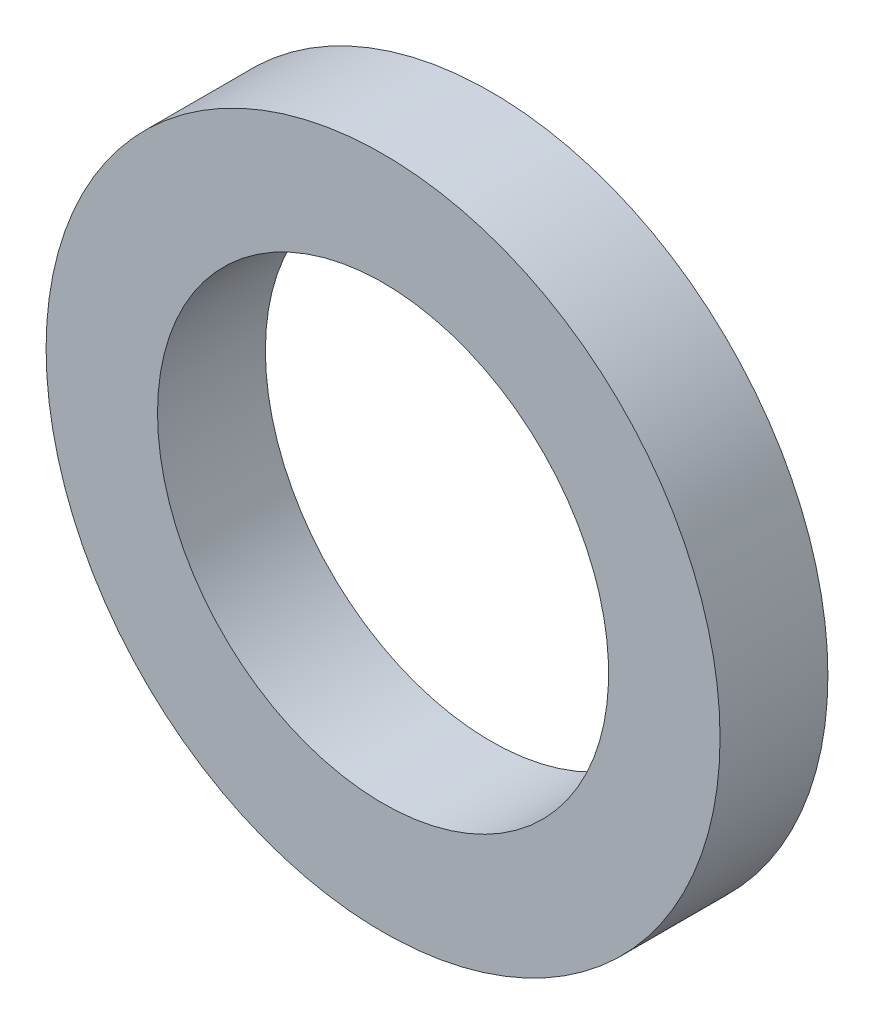
ISO-10303-21;
HEADER;
FILE_DESCRIPTION(('STEP AP214'),'2;1');
FILE_NAME('part.step','',(''),(''),'','','');
FILE_SCHEMA(('AUTOMOTIVE_DESIGN { 1 0 10303 214 1 1 1 1 }'));
ENDSEC;
DATA;
#1=APPLICATION_CONTEXT('core data for automotive mechanical design processes');
#2=APPLICATION_PROTOCOL_DEFINITION('international standard','automotive_design',2000,#1);
#3=PRODUCT_CONTEXT('',#1,'mechanical');
#4=PRODUCT('Part','Part','',(#3));
#5=PRODUCT_RELATED_PRODUCT_CATEGORY('part','',(#4));
#6=PRODUCT_DEFINITION_FORMATION('','',#4);
#7=PRODUCT_DEFINITION_CONTEXT('part definition',#1,'design');
#8=PRODUCT_DEFINITION('design','',#6,#7);
#9=PRODUCT_DEFINITION_SHAPE('','',#8);
#10=(LENGTH_UNIT() NAMED_UNIT(*) SI_UNIT(.MILLI.,.METRE.));
#11=(NAMED_UNIT(*) PLANE_ANGLE_UNIT() SI_UNIT($,.RADIAN.));
#12=(NAMED_UNIT(*) SI_UNIT($,.STERADIAN.) SOLID_ANGLE_UNIT());
#13=UNCERTAINTY_MEASURE_WITH_UNIT(LENGTH_MEASURE(1.E-05),#10,'distance_accuracy_value','');
#14=(GEOMETRIC_REPRESENTATION_CONTEXT(3) GLOBAL_UNCERTAINTY_ASSIGNED_CONTEXT((#13)) GLOBAL_UNIT_ASSIGNED_CONTEXT((#10,
#11,#12)) REPRESENTATION_CONTEXT('',''));
#15=CARTESIAN_POINT('',(0.,0.,0.));
#16=DIRECTION('',(0.,0.,1.));
#17=DIRECTION('',(1.,0.,0.));
#18=AXIS2_PLACEMENT_3D('',#15,#16,#17);
#19=CARTESIAN_POINT('',(0.,0.,-1.524));
#20=DIRECTION('',(0.,0.,-1.));
#21=DIRECTION('',(1.,0.,0.));
#22=AXIS2_PLACEMENT_3D('',#19,#20,#21);
#23=PLANE('',#22);
#24=CARTESIAN_POINT('',(0.,0.,-1.524));
#25=DIRECTION('',(0.,0.,1.));
#26=DIRECTION('',(1.,0.,0.));
#27=AXIS2_PLACEMENT_3D('',#24,#25,#26);
#28=CIRCLE('',#27,4.7625);
#29=CARTESIAN_POINT('',(-4.7625,0.,-1.524));
#30=VERTEX_POINT('',#29);
#31=EDGE_CURVE('E10',#30,#30,#28,.T.);
#32=ORIENTED_EDGE('',*,*,#31,.F.);
#33=EDGE_LOOP('',(#32));
#34=FACE_BOUND('',#33,.T.);
#35=CARTESIAN_POINT('',(0.,0.,-1.524));
#36=DIRECTION('',(0.,0.,1.));
#37=DIRECTION('',(1.,0.,0.));
#38=AXIS2_PLACEMENT_3D('',#35,#36,#37);
#39=CIRCLE('',#38,3.1877);
#40=CARTESIAN_POINT('',(-3.1877,0.,-1.524));
#41=VERTEX_POINT('',#40);
#42=EDGE_CURVE('E41',#41,#41,#39,.T.);
#43=ORIENTED_EDGE('',*,*,#42,.T.);
#44=EDGE_LOOP('',(#43));
#45=FACE_BOUND('',#44,.T.);
#46=ADVANCED_FACE('F30',(#34,#45),#23,.T.);
#47=CARTESIAN_POINT('',(0.,0.,0.));
#48=DIRECTION('',(0.,0.,-1.));
#49=DIRECTION('',(1.,0.,0.));
#50=AXIS2_PLACEMENT_3D('',#47,#48,#49);
#51=PLANE('',#50);
#52=CARTESIAN_POINT('',(0.,0.,0.));
#53=DIRECTION('',(0.,0.,1.));
#54=DIRECTION('',(1.,0.,0.));
#55=AXIS2_PLACEMENT_3D('',#52,#53,#54);
#56=CIRCLE('',#55,4.7625);
#57=CARTESIAN_POINT('',(-4.7625,0.,0.));
#58=VERTEX_POINT('',#57);
#59=EDGE_CURVE('E34',#58,#58,#56,.T.);
#60=ORIENTED_EDGE('',*,*,#59,.T.);
#61=EDGE_LOOP('',(#60));
#62=FACE_BOUND('',#61,.T.);
#63=CARTESIAN_POINT('',(0.,0.,0.));
#64=DIRECTION('',(0.,0.,1.));
#65=DIRECTION('',(1.,0.,0.));
#66=AXIS2_PLACEMENT_3D('',#63,#64,#65);
#67=CIRCLE('',#66,3.1877);
#68=CARTESIAN_POINT('',(-3.1877,0.,0.));
#69=VERTEX_POINT('',#68);
#70=EDGE_CURVE('E43',#69,#69,#67,.T.);
#71=ORIENTED_EDGE('',*,*,#70,.F.);
#72=EDGE_LOOP('',(#71));
#73=FACE_BOUND('',#72,.T.);
#74=ADVANCED_FACE('F56',(#62,#73),#51,.F.);
#75=CARTESIAN_POINT('',(0.,0.,-1.524));
#76=DIRECTION('',(0.,0.,1.));
#77=DIRECTION('',(-1.,0.,0.));
#78=AXIS2_PLACEMENT_3D('',#75,#76,#77);
#79=CYLINDRICAL_SURFACE('',#78,4.7625);
#80=CARTESIAN_POINT('',(-4.7625,0.,-1.524));
#81=CARTESIAN_POINT('',(-4.7625,0.,-1.508125));
#82=CARTESIAN_POINT('',(-4.7625,0.,-1.49225));
#83=CARTESIAN_POINT('',(-4.7625,0.,-1.4605));
#84=CARTESIAN_POINT('',(-4.7625,0.,-1.444625));
#85=CARTESIAN_POINT('',(-4.7625,0.,-1.412875));
#86=CARTESIAN_POINT('',(-4.7625,0.,-1.397));
#87=CARTESIAN_POINT('',(-4.7625,0.,-1.36525));
#88=CARTESIAN_POINT('',(-4.7625,0.,-1.349375));
#89=CARTESIAN_POINT('',(-4.7625,0.,-1.317625));
#90=CARTESIAN_POINT('',(-4.7625,0.,-1.30175));
#91=CARTESIAN_POINT('',(-4.7625,0.,-1.27));
#92=CARTESIAN_POINT('',(-4.7625,0.,-1.254125));
#93=CARTESIAN_POINT('',(-4.7625,0.,-1.222375));
#94=CARTESIAN_POINT('',(-4.7625,0.,-1.2065));
#95=CARTESIAN_POINT('',(-4.7625,0.,-1.17475));
#96=CARTESIAN_POINT('',(-4.7625,0.,-1.158875));
#97=CARTESIAN_POINT('',(-4.7625,0.,-1.127125));
#98=CARTESIAN_POINT('',(-4.7625,0.,-1.11125));
#99=CARTESIAN_POINT('',(-4.7625,0.,-1.0795));
#100=CARTESIAN_POINT('',(-4.7625,0.,-1.063625));
#101=CARTESIAN_POINT('',(-4.7625,0.,-1.031875));
#102=CARTESIAN_POINT('',(-4.7625,0.,-1.016));
#103=CARTESIAN_POINT('',(-4.7625,0.,-0.98425));
#104=CARTESIAN_POINT('',(-4.7625,0.,-0.968375));
#105=CARTESIAN_POINT('',(-4.7625,0.,-0.936625));
#106=CARTESIAN_POINT('',(-4.7625,0.,-0.92075));
#107=CARTESIAN_POINT('',(-4.7625,0.,-0.889));
#108=CARTESIAN_POINT('',(-4.7625,0.,-0.873125));
#109=CARTESIAN_POINT('',(-4.7625,0.,-0.841375));
#110=CARTESIAN_POINT('',(-4.7625,0.,-0.8255));
#111=CARTESIAN_POINT('',(-4.7625,0.,-0.79375));
#112=CARTESIAN_POINT('',(-4.7625,0.,-0.777875));
#113=CARTESIAN_POINT('',(-4.7625,0.,-0.746125));
#114=CARTESIAN_POINT('',(-4.7625,0.,-0.73025));
#115=CARTESIAN_POINT('',(-4.7625,0.,-0.6985));
#116=CARTESIAN_POINT('',(-4.7625,0.,-0.682625));
#117=CARTESIAN_POINT('',(-4.7625,0.,-0.650875));
#118=CARTESIAN_POINT('',(-4.7625,0.,-0.635));
#119=CARTESIAN_POINT('',(-4.7625,0.,-0.60325));
#120=CARTESIAN_POINT('',(-4.7625,0.,-0.587375));
#121=CARTESIAN_POINT('',(-4.7625,0.,-0.555625));
#122=CARTESIAN_POINT('',(-4.7625,0.,-0.53975));
#123=CARTESIAN_POINT('',(-4.7625,0.,-0.508));
#124=CARTESIAN_POINT('',(-4.7625,0.,-0.492125));
#125=CARTESIAN_POINT('',(-4.7625,0.,-0.460375));
#126=CARTESIAN_POINT('',(-4.7625,0.,-0.4445));
#127=CARTESIAN_POINT('',(-4.7625,0.,-0.41275));
#128=CARTESIAN_POINT('',(-4.7625,0.,-0.396875));
#129=CARTESIAN_POINT('',(-4.7625,0.,-0.365125));
#130=CARTESIAN_POINT('',(-4.7625,0.,-0.34925));
#131=CARTESIAN_POINT('',(-4.7625,0.,-0.3175));
#132=CARTESIAN_POINT('',(-4.7625,0.,-0.301625));
#133=CARTESIAN_POINT('',(-4.7625,0.,-0.269875));
#134=CARTESIAN_POINT('',(-4.7625,0.,-0.254));
#135=CARTESIAN_POINT('',(-4.7625,0.,-0.22225));
#136=CARTESIAN_POINT('',(-4.7625,0.,-0.206375));
#137=CARTESIAN_POINT('',(-4.7625,0.,-0.174625));
#138=CARTESIAN_POINT('',(-4.7625,0.,-0.15875));
#139=CARTESIAN_POINT('',(-4.7625,0.,-0.127));
#140=CARTESIAN_POINT('',(-4.7625,0.,-0.111125));
#141=CARTESIAN_POINT('',(-4.7625,0.,-0.079375));
#142=CARTESIAN_POINT('',(-4.7625,0.,-0.0635));
#143=CARTESIAN_POINT('',(-4.7625,0.,-0.0317499999999999));
#144=CARTESIAN_POINT('',(-4.7625,0.,-0.015875));
#145=CARTESIAN_POINT('',(-4.7625,0.,0.));
#146=B_SPLINE_CURVE_WITH_KNOTS('',3,(#80,#81,#82,#83,#84,#85,#86,#87,#88,#89,#90,#91,#92,#93,
#94,#95,#96,#97,#98,#99,#100,#101,#102,#103,#104,#105,#106,#107,#108,#109,#110,#111,#112,#113,
#114,#115,#116,#117,#118,#119,#120,#121,#122,#123,#124,#125,#126,#127,#128,#129,#130,#131,#132,
#133,#134,#135,#136,#137,#138,#139,#140,#141,#142,#143,#144,#145),.UNSPECIFIED.,.F.,.F.,(4,2,2,
2,2,2,2,2,2,2,2,2,2,2,2,2,2,2,2,2,2,2,2,2,2,2,2,2,2,2,2,2,4),(0.,0.0476250000000001,
0.0952500000000001,0.142875,0.1905,0.238125,0.28575,0.333375,0.381,0.428625,0.47625,0.523875,
0.5715,0.619125,0.66675,0.714375,0.762,0.809625,0.85725,0.904875,0.9525,1.000125,1.04775,
1.095375,1.143,1.190625,1.23825,1.285875,1.3335,1.381125,1.42875,1.476375,1.524),.UNSPECIFIED.);
#147=EDGE_CURVE('BSEAM32',#30,#58,#146,.T.);
#148=ORIENTED_EDGE('',*,*,#31,.T.);
#149=ORIENTED_EDGE('',*,*,#59,.F.);
#150=ORIENTED_EDGE('',*,*,#147,.T.);
#151=ORIENTED_EDGE('',*,*,#147,.F.);
#152=EDGE_LOOP('',(#148,#150,#149,#151));
#153=FACE_BOUND('',#152,.T.);
#154=ADVANCED_FACE('F32',(#153),#79,.T.);
#155=CARTESIAN_POINT('',(0.,0.,-1.524));
#156=DIRECTION('',(0.,0.,1.));
#157=DIRECTION('',(-1.,0.,0.));
#158=AXIS2_PLACEMENT_3D('',#155,#156,#157);
#159=CYLINDRICAL_SURFACE('',#158,3.1877);
#160=CARTESIAN_POINT('',(-3.1877,0.,-1.524));
#161=CARTESIAN_POINT('',(-3.1877,0.,-1.508125));
#162=CARTESIAN_POINT('',(-3.1877,0.,-1.49225));
#163=CARTESIAN_POINT('',(-3.1877,0.,-1.4605));
#164=CARTESIAN_POINT('',(-3.1877,0.,-1.444625));
#165=CARTESIAN_POINT('',(-3.1877,0.,-1.412875));
#166=CARTESIAN_POINT('',(-3.1877,0.,-1.397));
#167=CARTESIAN_POINT('',(-3.1877,0.,-1.36525));
#168=CARTESIAN_POINT('',(-3.1877,0.,-1.349375));
#169=CARTESIAN_POINT('',(-3.1877,0.,-1.317625));
#170=CARTESIAN_POINT('',(-3.1877,0.,-1.30175));
#171=CARTESIAN_POINT('',(-3.1877,0.,-1.27));
#172=CARTESIAN_POINT('',(-3.1877,0.,-1.254125));
#173=CARTESIAN_POINT('',(-3.1877,0.,-1.222375));
#174=CARTESIAN_POINT('',(-3.1877,0.,-1.2065));
#175=CARTESIAN_POINT('',(-3.1877,0.,-1.17475));
#176=CARTESIAN_POINT('',(-3.1877,0.,-1.158875));
#177=CARTESIAN_POINT('',(-3.1877,0.,-1.127125));
#178=CARTESIAN_POINT('',(-3.1877,0.,-1.11125));
#179=CARTESIAN_POINT('',(-3.1877,0.,-1.0795));
#180=CARTESIAN_POINT('',(-3.1877,0.,-1.063625));
#181=CARTESIAN_POINT('',(-3.1877,0.,-1.031875));
#182=CARTESIAN_POINT('',(-3.1877,0.,-1.016));
#183=CARTESIAN_POINT('',(-3.1877,0.,-0.98425));
#184=CARTESIAN_POINT('',(-3.1877,0.,-0.968375));
#185=CARTESIAN_POINT('',(-3.1877,0.,-0.936625));
#186=CARTESIAN_POINT('',(-3.1877,0.,-0.92075));
#187=CARTESIAN_POINT('',(-3.1877,0.,-0.889));
#188=CARTESIAN_POINT('',(-3.1877,0.,-0.873125));
#189=CARTESIAN_POINT('',(-3.1877,0.,-0.841375));
#190=CARTESIAN_POINT('',(-3.1877,0.,-0.8255));
#191=CARTESIAN_POINT('',(-3.1877,0.,-0.79375));
#192=CARTESIAN_POINT('',(-3.1877,0.,-0.777875));
#193=CARTESIAN_POINT('',(-3.1877,0.,-0.746125));
#194=CARTESIAN_POINT('',(-3.1877,0.,-0.73025));
#195=CARTESIAN_POINT('',(-3.1877,0.,-0.6985));
#196=CARTESIAN_POINT('',(-3.1877,0.,-0.682625));
#197=CARTESIAN_POINT('',(-3.1877,0.,-0.650875));
#198=CARTESIAN_POINT('',(-3.1877,0.,-0.635));
#199=CARTESIAN_POINT('',(-3.1877,0.,-0.60325));
#200=CARTESIAN_POINT('',(-3.1877,0.,-0.587375));
#201=CARTESIAN_POINT('',(-3.1877,0.,-0.555625));
#202=CARTESIAN_POINT('',(-3.1877,0.,-0.53975));
#203=CARTESIAN_POINT('',(-3.1877,0.,-0.508));
#204=CARTESIAN_POINT('',(-3.1877,0.,-0.492125));
#205=CARTESIAN_POINT('',(-3.1877,0.,-0.460375));
#206=CARTESIAN_POINT('',(-3.1877,0.,-0.4445));
#207=CARTESIAN_POINT('',(-3.1877,0.,-0.41275));
#208=CARTESIAN_POINT('',(-3.1877,0.,-0.396875));
#209=CARTESIAN_POINT('',(-3.1877,0.,-0.365125));
#210=CARTESIAN_POINT('',(-3.1877,0.,-0.34925));
#211=CARTESIAN_POINT('',(-3.1877,0.,-0.3175));
#212=CARTESIAN_POINT('',(-3.1877,0.,-0.301625));
#213=CARTESIAN_POINT('',(-3.1877,0.,-0.269875));
#214=CARTESIAN_POINT('',(-3.1877,0.,-0.254));
#215=CARTESIAN_POINT('',(-3.1877,0.,-0.22225));
#216=CARTESIAN_POINT('',(-3.1877,0.,-0.206375));
#217=CARTESIAN_POINT('',(-3.1877,0.,-0.174625));
#218=CARTESIAN_POINT('',(-3.1877,0.,-0.15875));
#219=CARTESIAN_POINT('',(-3.1877,0.,-0.127));
#220=CARTESIAN_POINT('',(-3.1877,0.,-0.111125));
#221=CARTESIAN_POINT('',(-3.1877,0.,-0.079375));
#222=CARTESIAN_POINT('',(-3.1877,0.,-0.0635));
#223=CARTESIAN_POINT('',(-3.1877,0.,-0.0317499999999999));
#224=CARTESIAN_POINT('',(-3.1877,0.,-0.015875));
#225=CARTESIAN_POINT('',(-3.1877,0.,0.));
#226=B_SPLINE_CURVE_WITH_KNOTS('',3,(#160,#161,#162,#163,#164,#165,#166,#167,#168,#169,#170,
#171,#172,#173,#174,#175,#176,#177,#178,#179,#180,#181,#182,#183,#184,#185,#186,#187,#188,#189,
#190,#191,#192,#193,#194,#195,#196,#197,#198,#199,#200,#201,#202,#203,#204,#205,#206,#207,#208,
#209,#210,#211,#212,#213,#214,#215,#216,#217,#218,#219,#220,#221,#222,#223,#224,#225),
.UNSPECIFIED.,.F.,.F.,(4,2,2,2,2,2,2,2,2,2,2,2,2,2,2,2,2,2,2,2,2,2,2,2,2,2,2,2,2,2,2,2,4),(0.,
0.0476249999999999,0.0952499999999998,0.142875,0.1905,0.238125,0.28575,0.333375,0.381,0.428625,
0.47625,0.523875,0.5715,0.619125,0.66675,0.714375,0.762,0.809625,0.85725,0.904875,0.9525,
1.000125,1.04775,1.095375,1.143,1.190625,1.23825,1.285875,1.3335,1.381125,1.42875,1.476375,
1.524),.UNSPECIFIED.);
#227=EDGE_CURVE('BSEAM50',#41,#69,#226,.T.);
#228=ORIENTED_EDGE('',*,*,#42,.F.);
#229=ORIENTED_EDGE('',*,*,#70,.T.);
#230=ORIENTED_EDGE('',*,*,#227,.T.);
#231=ORIENTED_EDGE('',*,*,#227,.F.);
#232=EDGE_LOOP('',(#228,#230,#229,#231));
#233=FACE_BOUND('',#232,.T.);
#234=ADVANCED_FACE('F50',(#233),#159,.F.);
#235=CLOSED_SHELL('',(#46,#74,#154,#234));
#236=MANIFOLD_SOLID_BREP('B2',#235);
#237=ADVANCED_BREP_SHAPE_REPRESENTATION('',(#18,#236),#14);
#238=SHAPE_DEFINITION_REPRESENTATION(#9,#237);
ENDSEC;
END-ISO-10303-21;
